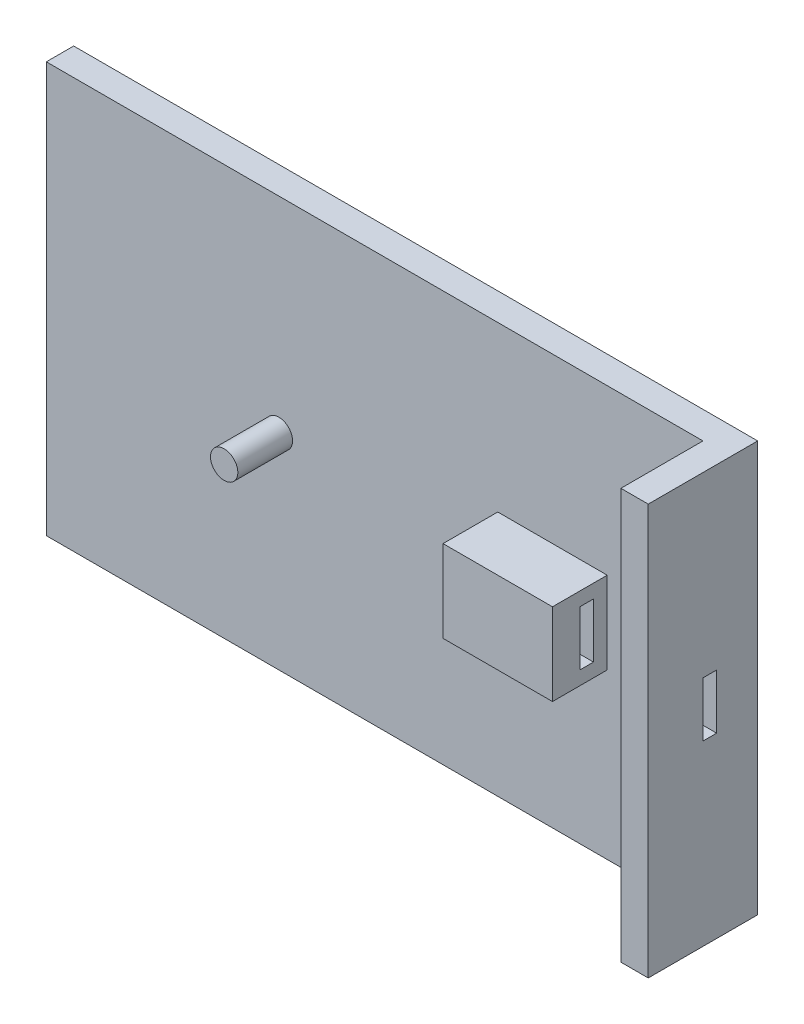
ISO-10303-21;
HEADER;
FILE_DESCRIPTION(('STEP AP214'),'2;1');
FILE_NAME('part.step','',(''),(''),'','','');
FILE_SCHEMA(('AUTOMOTIVE_DESIGN { 1 0 10303 214 1 1 1 1 }'));
ENDSEC;
DATA;
#1=APPLICATION_CONTEXT('core data for automotive mechanical design processes');
#2=APPLICATION_PROTOCOL_DEFINITION('international standard','automotive_design',2000,#1);
#3=PRODUCT_CONTEXT('',#1,'mechanical');
#4=PRODUCT('Part','Part','',(#3));
#5=PRODUCT_RELATED_PRODUCT_CATEGORY('part','',(#4));
#6=PRODUCT_DEFINITION_FORMATION('','',#4);
#7=PRODUCT_DEFINITION_CONTEXT('part definition',#1,'design');
#8=PRODUCT_DEFINITION('design','',#6,#7);
#9=PRODUCT_DEFINITION_SHAPE('','',#8);
#10=(LENGTH_UNIT() NAMED_UNIT(*) SI_UNIT(.MILLI.,.METRE.));
#11=(NAMED_UNIT(*) PLANE_ANGLE_UNIT() SI_UNIT($,.RADIAN.));
#12=(NAMED_UNIT(*) SI_UNIT($,.STERADIAN.) SOLID_ANGLE_UNIT());
#13=UNCERTAINTY_MEASURE_WITH_UNIT(LENGTH_MEASURE(1.E-05),#10,'distance_accuracy_value','');
#14=(GEOMETRIC_REPRESENTATION_CONTEXT(3) GLOBAL_UNCERTAINTY_ASSIGNED_CONTEXT((#13)) GLOBAL_UNIT_ASSIGNED_CONTEXT((#10,
#11,#12)) REPRESENTATION_CONTEXT('',''));
#15=CARTESIAN_POINT('',(0.,0.,0.));
#16=DIRECTION('',(0.,0.,1.));
#17=DIRECTION('',(1.,0.,0.));
#18=AXIS2_PLACEMENT_3D('',#15,#16,#17);
#19=CARTESIAN_POINT('',(0.,0.,10.));
#20=DIRECTION('',(0.,0.,1.));
#21=DIRECTION('',(1.,0.,0.));
#22=AXIS2_PLACEMENT_3D('',#19,#20,#21);
#23=PLANE('',#22);
#24=DIRECTION('',(1.,0.,0.));
#25=VECTOR('',#24,1.);
#26=CARTESIAN_POINT('',(0.,15.,10.));
#27=LINE('',#26,#25);
#28=CARTESIAN_POINT('',(40.,15.,10.));
#29=VERTEX_POINT('',#28);
#30=CARTESIAN_POINT('',(80.,15.,10.));
#31=VERTEX_POINT('',#30);
#32=EDGE_CURVE('E294',#29,#31,#27,.T.);
#33=ORIENTED_EDGE('',*,*,#32,.T.);
#34=DIRECTION('',(0.,-1.,0.));
#35=VECTOR('',#34,1.);
#36=CARTESIAN_POINT('',(80.,0.,10.));
#37=LINE('',#36,#35);
#38=CARTESIAN_POINT('',(80.,-15.,10.));
#39=VERTEX_POINT('',#38);
#40=EDGE_CURVE('E281',#31,#39,#37,.T.);
#41=ORIENTED_EDGE('',*,*,#40,.T.);
#42=DIRECTION('',(1.,0.,0.));
#43=VECTOR('',#42,1.);
#44=CARTESIAN_POINT('',(0.,-15.,10.));
#45=LINE('',#44,#43);
#46=CARTESIAN_POINT('',(40.,-15.,10.));
#47=VERTEX_POINT('',#46);
#48=EDGE_CURVE('E284',#47,#39,#45,.T.);
#49=ORIENTED_EDGE('',*,*,#48,.F.);
#50=DIRECTION('',(0.,-1.,0.));
#51=VECTOR('',#50,1.);
#52=CARTESIAN_POINT('',(40.,0.,10.));
#53=LINE('',#52,#51);
#54=EDGE_CURVE('E278',#29,#47,#53,.T.);
#55=ORIENTED_EDGE('',*,*,#54,.F.);
#56=EDGE_LOOP('',(#33,#41,#49,#55));
#57=FACE_BOUND('',#56,.T.);
#58=CARTESIAN_POINT('',(-40.,0.,10.));
#59=DIRECTION('',(0.,0.,1.));
#60=DIRECTION('',(1.,0.,0.));
#61=AXIS2_PLACEMENT_3D('',#58,#59,#60);
#62=CIRCLE('',#61,5.);
#63=CARTESIAN_POINT('',(-35.,0.,10.));
#64=VERTEX_POINT('',#63);
#65=EDGE_CURVE('E275',#64,#64,#62,.T.);
#66=ORIENTED_EDGE('',*,*,#65,.F.);
#67=EDGE_LOOP('',(#66));
#68=FACE_BOUND('',#67,.T.);
#69=DIRECTION('',(1.,0.,0.));
#70=VECTOR('',#69,1.);
#71=CARTESIAN_POINT('',(0.,-75.,10.));
#72=LINE('',#71,#70);
#73=CARTESIAN_POINT('',(-125.,-75.,10.));
#74=VERTEX_POINT('',#73);
#75=CARTESIAN_POINT('',(115.,-75.,10.));
#76=VERTEX_POINT('',#75);
#77=EDGE_CURVE('E289',#74,#76,#72,.T.);
#78=ORIENTED_EDGE('',*,*,#77,.T.);
#79=DIRECTION('',(0.,1.,0.));
#80=VECTOR('',#79,1.);
#81=CARTESIAN_POINT('',(115.,0.,10.));
#82=LINE('',#81,#80);
#83=CARTESIAN_POINT('',(115.,75.,10.));
#84=VERTEX_POINT('',#83);
#85=EDGE_CURVE('E272',#76,#84,#82,.T.);
#86=ORIENTED_EDGE('',*,*,#85,.T.);
#87=DIRECTION('',(1.,0.,0.));
#88=VECTOR('',#87,1.);
#89=CARTESIAN_POINT('',(0.,75.,10.));
#90=LINE('',#89,#88);
#91=CARTESIAN_POINT('',(-125.,75.,10.));
#92=VERTEX_POINT('',#91);
#93=EDGE_CURVE('E291',#92,#84,#90,.T.);
#94=ORIENTED_EDGE('',*,*,#93,.F.);
#95=DIRECTION('',(0.,-1.,0.));
#96=VECTOR('',#95,1.);
#97=CARTESIAN_POINT('',(-125.,0.,10.));
#98=LINE('',#97,#96);
#99=EDGE_CURVE('E286',#92,#74,#98,.T.);
#100=ORIENTED_EDGE('',*,*,#99,.T.);
#101=EDGE_LOOP('',(#78,#86,#94,#100));
#102=FACE_BOUND('',#101,.T.);
#103=ADVANCED_FACE('F39',(#57,#68,#102),#23,.T.);
#104=CARTESIAN_POINT('',(-125.,0.,10.));
#105=DIRECTION('',(1.,0.,0.));
#106=DIRECTION('',(0.,0.,-1.));
#107=AXIS2_PLACEMENT_3D('',#104,#105,#106);
#108=PLANE('',#107);
#109=DIRECTION('',(0.,-1.,0.));
#110=VECTOR('',#109,1.);
#111=CARTESIAN_POINT('',(-125.,0.,0.));
#112=LINE('',#111,#110);
#113=CARTESIAN_POINT('',(-125.,75.,0.));
#114=VERTEX_POINT('',#113);
#115=CARTESIAN_POINT('',(-125.,-75.,0.));
#116=VERTEX_POINT('',#115);
#117=EDGE_CURVE('E274',#114,#116,#112,.T.);
#118=ORIENTED_EDGE('',*,*,#117,.T.);
#119=DIRECTION('',(0.,0.,-1.));
#120=VECTOR('',#119,1.);
#121=CARTESIAN_POINT('',(-125.,-75.,10.));
#122=LINE('',#121,#120);
#123=EDGE_CURVE('E47',#74,#116,#122,.T.);
#124=ORIENTED_EDGE('',*,*,#123,.F.);
#125=ORIENTED_EDGE('',*,*,#99,.F.);
#126=DIRECTION('',(0.,0.,-1.));
#127=VECTOR('',#126,1.);
#128=CARTESIAN_POINT('',(-125.,75.,10.));
#129=LINE('',#128,#127);
#130=EDGE_CURVE('E297',#92,#114,#129,.T.);
#131=ORIENTED_EDGE('',*,*,#130,.T.);
#132=EDGE_LOOP('',(#118,#124,#125,#131));
#133=FACE_BOUND('',#132,.T.);
#134=ADVANCED_FACE('F41',(#133),#108,.F.);
#135=CARTESIAN_POINT('',(0.,-75.,10.));
#136=DIRECTION('',(0.,1.,0.));
#137=DIRECTION('',(0.,0.,1.));
#138=AXIS2_PLACEMENT_3D('',#135,#136,#137);
#139=PLANE('',#138);
#140=DIRECTION('',(0.,0.,-1.));
#141=VECTOR('',#140,1.);
#142=CARTESIAN_POINT('',(125.,-75.,10.));
#143=LINE('',#142,#141);
#144=CARTESIAN_POINT('',(125.,-75.,40.));
#145=VERTEX_POINT('',#144);
#146=CARTESIAN_POINT('',(125.,-75.,0.));
#147=VERTEX_POINT('',#146);
#148=EDGE_CURVE('E310',#145,#147,#143,.T.);
#149=ORIENTED_EDGE('',*,*,#148,.F.);
#150=DIRECTION('',(1.,0.,0.));
#151=VECTOR('',#150,1.);
#152=CARTESIAN_POINT('',(0.,-75.,40.));
#153=LINE('',#152,#151);
#154=CARTESIAN_POINT('',(115.,-75.,40.));
#155=VERTEX_POINT('',#154);
#156=EDGE_CURVE('E263',#155,#145,#153,.T.);
#157=ORIENTED_EDGE('',*,*,#156,.F.);
#158=DIRECTION('',(0.,0.,-1.));
#159=VECTOR('',#158,1.);
#160=CARTESIAN_POINT('',(115.,-75.,40.));
#161=LINE('',#160,#159);
#162=EDGE_CURVE('E266',#155,#76,#161,.T.);
#163=ORIENTED_EDGE('',*,*,#162,.T.);
#164=ORIENTED_EDGE('',*,*,#77,.F.);
#165=ORIENTED_EDGE('',*,*,#123,.T.);
#166=DIRECTION('',(1.,0.,0.));
#167=VECTOR('',#166,1.);
#168=CARTESIAN_POINT('',(0.,-75.,0.));
#169=LINE('',#168,#167);
#170=EDGE_CURVE('E300',#116,#147,#169,.T.);
#171=ORIENTED_EDGE('',*,*,#170,.T.);
#172=EDGE_LOOP('',(#149,#157,#163,#164,#165,#171));
#173=FACE_BOUND('',#172,.T.);
#174=ADVANCED_FACE('F315',(#173),#139,.F.);
#175=CARTESIAN_POINT('',(125.,0.,10.));
#176=DIRECTION('',(1.,0.,0.));
#177=DIRECTION('',(0.,0.,-1.));
#178=AXIS2_PLACEMENT_3D('',#175,#176,#177);
#179=PLANE('',#178);
#180=DIRECTION('',(0.,0.,1.));
#181=VECTOR('',#180,1.);
#182=CARTESIAN_POINT('',(125.,-10.,15.));
#183=LINE('',#182,#181);
#184=CARTESIAN_POINT('',(125.,-10.,15.));
#185=VERTEX_POINT('',#184);
#186=CARTESIAN_POINT('',(125.,-10.,20.));
#187=VERTEX_POINT('',#186);
#188=EDGE_CURVE('E178',#185,#187,#183,.T.);
#189=ORIENTED_EDGE('',*,*,#188,.T.);
#190=DIRECTION('',(0.,1.,0.));
#191=VECTOR('',#190,1.);
#192=CARTESIAN_POINT('',(125.,10.,20.));
#193=LINE('',#192,#191);
#194=CARTESIAN_POINT('',(125.,10.,20.));
#195=VERTEX_POINT('',#194);
#196=EDGE_CURVE('E165',#187,#195,#193,.T.);
#197=ORIENTED_EDGE('',*,*,#196,.T.);
#198=DIRECTION('',(0.,0.,-1.));
#199=VECTOR('',#198,1.);
#200=CARTESIAN_POINT('',(125.,10.,15.));
#201=LINE('',#200,#199);
#202=CARTESIAN_POINT('',(125.,10.,15.));
#203=VERTEX_POINT('',#202);
#204=EDGE_CURVE('E196',#195,#203,#201,.T.);
#205=ORIENTED_EDGE('',*,*,#204,.T.);
#206=DIRECTION('',(0.,-1.,0.));
#207=VECTOR('',#206,1.);
#208=CARTESIAN_POINT('',(125.,10.,15.));
#209=LINE('',#208,#207);
#210=EDGE_CURVE('E186',#203,#185,#209,.T.);
#211=ORIENTED_EDGE('',*,*,#210,.T.);
#212=EDGE_LOOP('',(#189,#197,#205,#211));
#213=FACE_BOUND('',#212,.T.);
#214=DIRECTION('',(0.,-1.,0.));
#215=VECTOR('',#214,1.);
#216=CARTESIAN_POINT('',(125.,0.,0.));
#217=LINE('',#216,#215);
#218=CARTESIAN_POINT('',(125.,75.,0.));
#219=VERTEX_POINT('',#218);
#220=EDGE_CURVE('E302',#219,#147,#217,.T.);
#221=ORIENTED_EDGE('',*,*,#220,.F.);
#222=DIRECTION('',(0.,0.,-1.));
#223=VECTOR('',#222,1.);
#224=CARTESIAN_POINT('',(125.,75.,10.));
#225=LINE('',#224,#223);
#226=CARTESIAN_POINT('',(125.,75.,40.));
#227=VERTEX_POINT('',#226);
#228=EDGE_CURVE('E307',#227,#219,#225,.T.);
#229=ORIENTED_EDGE('',*,*,#228,.F.);
#230=DIRECTION('',(0.,-1.,0.));
#231=VECTOR('',#230,1.);
#232=CARTESIAN_POINT('',(125.,0.,40.));
#233=LINE('',#232,#231);
#234=EDGE_CURVE('E255',#227,#145,#233,.T.);
#235=ORIENTED_EDGE('',*,*,#234,.T.);
#236=ORIENTED_EDGE('',*,*,#148,.T.);
#237=EDGE_LOOP('',(#221,#229,#235,#236));
#238=FACE_BOUND('',#237,.T.);
#239=ADVANCED_FACE('F184',(#213,#238),#179,.T.);
#240=CARTESIAN_POINT('',(0.,75.,10.));
#241=DIRECTION('',(0.,1.,0.));
#242=DIRECTION('',(0.,0.,1.));
#243=AXIS2_PLACEMENT_3D('',#240,#241,#242);
#244=PLANE('',#243);
#245=ORIENTED_EDGE('',*,*,#228,.T.);
#246=DIRECTION('',(1.,0.,0.));
#247=VECTOR('',#246,1.);
#248=CARTESIAN_POINT('',(0.,75.,0.));
#249=LINE('',#248,#247);
#250=EDGE_CURVE('E279',#114,#219,#249,.T.);
#251=ORIENTED_EDGE('',*,*,#250,.F.);
#252=ORIENTED_EDGE('',*,*,#130,.F.);
#253=ORIENTED_EDGE('',*,*,#93,.T.);
#254=DIRECTION('',(0.,0.,-1.));
#255=VECTOR('',#254,1.);
#256=CARTESIAN_POINT('',(115.,75.,40.));
#257=LINE('',#256,#255);
#258=CARTESIAN_POINT('',(115.,75.,40.));
#259=VERTEX_POINT('',#258);
#260=EDGE_CURVE('E269',#259,#84,#257,.T.);
#261=ORIENTED_EDGE('',*,*,#260,.F.);
#262=DIRECTION('',(1.,0.,0.));
#263=VECTOR('',#262,1.);
#264=CARTESIAN_POINT('',(0.,75.,40.));
#265=LINE('',#264,#263);
#266=EDGE_CURVE('E258',#259,#227,#265,.T.);
#267=ORIENTED_EDGE('',*,*,#266,.T.);
#268=EDGE_LOOP('',(#245,#251,#252,#253,#261,#267));
#269=FACE_BOUND('',#268,.T.);
#270=ADVANCED_FACE('F323',(#269),#244,.T.);
#271=CARTESIAN_POINT('',(0.,0.,0.));
#272=DIRECTION('',(0.,0.,1.));
#273=DIRECTION('',(1.,0.,0.));
#274=AXIS2_PLACEMENT_3D('',#271,#272,#273);
#275=PLANE('',#274);
#276=ORIENTED_EDGE('',*,*,#220,.T.);
#277=ORIENTED_EDGE('',*,*,#170,.F.);
#278=ORIENTED_EDGE('',*,*,#117,.F.);
#279=ORIENTED_EDGE('',*,*,#250,.T.);
#280=EDGE_LOOP('',(#276,#277,#278,#279));
#281=FACE_BOUND('',#280,.T.);
#282=ADVANCED_FACE('F321',(#281),#275,.F.);
#283=CARTESIAN_POINT('',(115.,0.,40.));
#284=DIRECTION('',(1.,0.,0.));
#285=DIRECTION('',(0.,0.,-1.));
#286=AXIS2_PLACEMENT_3D('',#283,#284,#285);
#287=PLANE('',#286);
#288=DIRECTION('',(0.,1.,0.));
#289=VECTOR('',#288,1.);
#290=CARTESIAN_POINT('',(115.,10.,20.));
#291=LINE('',#290,#289);
#292=CARTESIAN_POINT('',(115.,-10.,20.));
#293=VERTEX_POINT('',#292);
#294=CARTESIAN_POINT('',(115.,10.,20.));
#295=VERTEX_POINT('',#294);
#296=EDGE_CURVE('E188',#293,#295,#291,.T.);
#297=ORIENTED_EDGE('',*,*,#296,.F.);
#298=DIRECTION('',(0.,0.,1.));
#299=VECTOR('',#298,1.);
#300=CARTESIAN_POINT('',(115.,-10.,15.));
#301=LINE('',#300,#299);
#302=CARTESIAN_POINT('',(115.,-10.,15.));
#303=VERTEX_POINT('',#302);
#304=EDGE_CURVE('E181',#303,#293,#301,.T.);
#305=ORIENTED_EDGE('',*,*,#304,.F.);
#306=DIRECTION('',(0.,-1.,0.));
#307=VECTOR('',#306,1.);
#308=CARTESIAN_POINT('',(115.,10.,15.));
#309=LINE('',#308,#307);
#310=CARTESIAN_POINT('',(115.,10.,15.));
#311=VERTEX_POINT('',#310);
#312=EDGE_CURVE('E192',#311,#303,#309,.T.);
#313=ORIENTED_EDGE('',*,*,#312,.F.);
#314=DIRECTION('',(0.,0.,-1.));
#315=VECTOR('',#314,1.);
#316=CARTESIAN_POINT('',(115.,10.,15.));
#317=LINE('',#316,#315);
#318=EDGE_CURVE('E62',#295,#311,#317,.T.);
#319=ORIENTED_EDGE('',*,*,#318,.F.);
#320=EDGE_LOOP('',(#297,#305,#313,#319));
#321=FACE_BOUND('',#320,.T.);
#322=ORIENTED_EDGE('',*,*,#85,.F.);
#323=ORIENTED_EDGE('',*,*,#162,.F.);
#324=DIRECTION('',(0.,-1.,0.));
#325=VECTOR('',#324,1.);
#326=CARTESIAN_POINT('',(115.,0.,40.));
#327=LINE('',#326,#325);
#328=EDGE_CURVE('E261',#259,#155,#327,.T.);
#329=ORIENTED_EDGE('',*,*,#328,.F.);
#330=ORIENTED_EDGE('',*,*,#260,.T.);
#331=EDGE_LOOP('',(#322,#323,#329,#330));
#332=FACE_BOUND('',#331,.T.);
#333=ADVANCED_FACE('F334',(#321,#332),#287,.F.);
#334=CARTESIAN_POINT('',(0.,0.,40.));
#335=DIRECTION('',(0.,0.,1.));
#336=DIRECTION('',(1.,0.,0.));
#337=AXIS2_PLACEMENT_3D('',#334,#335,#336);
#338=PLANE('',#337);
#339=ORIENTED_EDGE('',*,*,#234,.F.);
#340=ORIENTED_EDGE('',*,*,#266,.F.);
#341=ORIENTED_EDGE('',*,*,#328,.T.);
#342=ORIENTED_EDGE('',*,*,#156,.T.);
#343=EDGE_LOOP('',(#339,#340,#341,#342));
#344=FACE_BOUND('',#343,.T.);
#345=ADVANCED_FACE('F329',(#344),#338,.T.);
#346=CARTESIAN_POINT('',(-40.,0.,30.));
#347=DIRECTION('',(0.,0.,-1.));
#348=DIRECTION('',(-1.,0.,0.));
#349=AXIS2_PLACEMENT_3D('',#346,#347,#348);
#350=CYLINDRICAL_SURFACE('',#349,5.);
#351=ORIENTED_EDGE('',*,*,#65,.T.);
#352=EDGE_LOOP('',(#351));
#353=FACE_BOUND('',#352,.T.);
#354=CARTESIAN_POINT('',(-40.,0.,30.));
#355=DIRECTION('',(0.,0.,1.));
#356=DIRECTION('',(1.,0.,0.));
#357=AXIS2_PLACEMENT_3D('',#354,#355,#356);
#358=CIRCLE('',#357,5.);
#359=CARTESIAN_POINT('',(-35.,0.,30.));
#360=VERTEX_POINT('',#359);
#361=EDGE_CURVE('E252',#360,#360,#358,.T.);
#362=ORIENTED_EDGE('',*,*,#361,.F.);
#363=EDGE_LOOP('',(#362));
#364=FACE_BOUND('',#363,.T.);
#365=ADVANCED_FACE('F385',(#353,#364),#350,.T.);
#366=CARTESIAN_POINT('',(0.,0.,30.));
#367=DIRECTION('',(0.,0.,1.));
#368=DIRECTION('',(1.,0.,0.));
#369=AXIS2_PLACEMENT_3D('',#366,#367,#368);
#370=PLANE('',#369);
#371=ORIENTED_EDGE('',*,*,#361,.T.);
#372=EDGE_LOOP('',(#371));
#373=FACE_BOUND('',#372,.T.);
#374=ADVANCED_FACE('F391',(#373),#370,.T.);
#375=CARTESIAN_POINT('',(40.,15.,30.));
#376=DIRECTION('',(1.,0.,0.));
#377=DIRECTION('',(0.,0.,-1.));
#378=AXIS2_PLACEMENT_3D('',#375,#376,#377);
#379=PLANE('',#378);
#380=DIRECTION('',(0.,-1.,0.));
#381=VECTOR('',#380,1.);
#382=CARTESIAN_POINT('',(40.,10.,20.));
#383=LINE('',#382,#381);
#384=CARTESIAN_POINT('',(40.,10.,20.));
#385=VERTEX_POINT('',#384);
#386=CARTESIAN_POINT('',(40.,-10.,20.));
#387=VERTEX_POINT('',#386);
#388=EDGE_CURVE('E201',#385,#387,#383,.T.);
#389=ORIENTED_EDGE('',*,*,#388,.T.);
#390=DIRECTION('',(0.,0.,-1.));
#391=VECTOR('',#390,1.);
#392=CARTESIAN_POINT('',(40.,-10.,30.));
#393=LINE('',#392,#391);
#394=CARTESIAN_POINT('',(40.,-10.,15.));
#395=VERTEX_POINT('',#394);
#396=EDGE_CURVE('E230',#387,#395,#393,.T.);
#397=ORIENTED_EDGE('',*,*,#396,.T.);
#398=DIRECTION('',(0.,1.,0.));
#399=VECTOR('',#398,1.);
#400=CARTESIAN_POINT('',(40.,10.,15.));
#401=LINE('',#400,#399);
#402=CARTESIAN_POINT('',(40.,10.,15.));
#403=VERTEX_POINT('',#402);
#404=EDGE_CURVE('E208',#395,#403,#401,.T.);
#405=ORIENTED_EDGE('',*,*,#404,.T.);
#406=DIRECTION('',(0.,0.,-1.));
#407=VECTOR('',#406,1.);
#408=CARTESIAN_POINT('',(40.,10.,30.));
#409=LINE('',#408,#407);
#410=EDGE_CURVE('E250',#385,#403,#409,.T.);
#411=ORIENTED_EDGE('',*,*,#410,.F.);
#412=EDGE_LOOP('',(#389,#397,#405,#411));
#413=FACE_BOUND('',#412,.T.);
#414=DIRECTION('',(0.,0.,-1.));
#415=VECTOR('',#414,1.);
#416=CARTESIAN_POINT('',(40.,-15.,30.));
#417=LINE('',#416,#415);
#418=CARTESIAN_POINT('',(40.,-15.,30.));
#419=VERTEX_POINT('',#418);
#420=EDGE_CURVE('E220',#419,#47,#417,.T.);
#421=ORIENTED_EDGE('',*,*,#420,.F.);
#422=DIRECTION('',(0.,-1.,0.));
#423=VECTOR('',#422,1.);
#424=CARTESIAN_POINT('',(40.,15.,30.));
#425=LINE('',#424,#423);
#426=CARTESIAN_POINT('',(40.,15.,30.));
#427=VERTEX_POINT('',#426);
#428=EDGE_CURVE('E235',#427,#419,#425,.T.);
#429=ORIENTED_EDGE('',*,*,#428,.F.);
#430=DIRECTION('',(0.,0.,-1.));
#431=VECTOR('',#430,1.);
#432=CARTESIAN_POINT('',(40.,15.,30.));
#433=LINE('',#432,#431);
#434=EDGE_CURVE('E242',#427,#29,#433,.T.);
#435=ORIENTED_EDGE('',*,*,#434,.T.);
#436=ORIENTED_EDGE('',*,*,#54,.T.);
#437=EDGE_LOOP('',(#421,#429,#435,#436));
#438=FACE_BOUND('',#437,.T.);
#439=ADVANCED_FACE('F398',(#413,#438),#379,.F.);
#440=CARTESIAN_POINT('',(40.,10.,30.));
#441=DIRECTION('',(0.,1.,0.));
#442=DIRECTION('',(-1.,0.,0.));
#443=AXIS2_PLACEMENT_3D('',#440,#441,#442);
#444=PLANE('',#443);
#445=DIRECTION('',(0.,0.,-1.));
#446=VECTOR('',#445,1.);
#447=CARTESIAN_POINT('',(80.,10.,30.));
#448=LINE('',#447,#446);
#449=CARTESIAN_POINT('',(80.,10.,20.));
#450=VERTEX_POINT('',#449);
#451=CARTESIAN_POINT('',(80.,10.,15.));
#452=VERTEX_POINT('',#451);
#453=EDGE_CURVE('E248',#450,#452,#448,.T.);
#454=ORIENTED_EDGE('',*,*,#453,.F.);
#455=DIRECTION('',(-1.,0.,0.));
#456=VECTOR('',#455,1.);
#457=CARTESIAN_POINT('',(102.556566506766,10.,20.));
#458=LINE('',#457,#456);
#459=EDGE_CURVE('E204',#450,#385,#458,.T.);
#460=ORIENTED_EDGE('',*,*,#459,.T.);
#461=ORIENTED_EDGE('',*,*,#410,.T.);
#462=DIRECTION('',(-1.,0.,0.));
#463=VECTOR('',#462,1.);
#464=CARTESIAN_POINT('',(102.556566506766,10.,15.));
#465=LINE('',#464,#463);
#466=EDGE_CURVE('E217',#452,#403,#465,.T.);
#467=ORIENTED_EDGE('',*,*,#466,.F.);
#468=EDGE_LOOP('',(#454,#460,#461,#467));
#469=FACE_BOUND('',#468,.T.);
#470=ADVANCED_FACE('F406',(#469),#444,.F.);
#471=CARTESIAN_POINT('',(80.,15.,30.));
#472=DIRECTION('',(1.,0.,0.));
#473=DIRECTION('',(0.,0.,-1.));
#474=AXIS2_PLACEMENT_3D('',#471,#472,#473);
#475=PLANE('',#474);
#476=DIRECTION('',(0.,-1.,0.));
#477=VECTOR('',#476,1.);
#478=CARTESIAN_POINT('',(80.,10.,20.));
#479=LINE('',#478,#477);
#480=CARTESIAN_POINT('',(80.,-10.,20.));
#481=VERTEX_POINT('',#480);
#482=EDGE_CURVE('E205',#450,#481,#479,.T.);
#483=ORIENTED_EDGE('',*,*,#482,.F.);
#484=ORIENTED_EDGE('',*,*,#453,.T.);
#485=DIRECTION('',(0.,1.,0.));
#486=VECTOR('',#485,1.);
#487=CARTESIAN_POINT('',(80.,10.,15.));
#488=LINE('',#487,#486);
#489=CARTESIAN_POINT('',(80.,-10.,15.));
#490=VERTEX_POINT('',#489);
#491=EDGE_CURVE('E214',#490,#452,#488,.T.);
#492=ORIENTED_EDGE('',*,*,#491,.F.);
#493=DIRECTION('',(0.,0.,-1.));
#494=VECTOR('',#493,1.);
#495=CARTESIAN_POINT('',(80.,-10.,30.));
#496=LINE('',#495,#494);
#497=EDGE_CURVE('E228',#481,#490,#496,.T.);
#498=ORIENTED_EDGE('',*,*,#497,.F.);
#499=EDGE_LOOP('',(#483,#484,#492,#498));
#500=FACE_BOUND('',#499,.T.);
#501=DIRECTION('',(0.,-1.,0.));
#502=VECTOR('',#501,1.);
#503=CARTESIAN_POINT('',(80.,15.,30.));
#504=LINE('',#503,#502);
#505=CARTESIAN_POINT('',(80.,15.,30.));
#506=VERTEX_POINT('',#505);
#507=CARTESIAN_POINT('',(80.,-15.,30.));
#508=VERTEX_POINT('',#507);
#509=EDGE_CURVE('E237',#506,#508,#504,.T.);
#510=ORIENTED_EDGE('',*,*,#509,.T.);
#511=DIRECTION('',(0.,0.,-1.));
#512=VECTOR('',#511,1.);
#513=CARTESIAN_POINT('',(80.,-15.,30.));
#514=LINE('',#513,#512);
#515=EDGE_CURVE('E225',#508,#39,#514,.T.);
#516=ORIENTED_EDGE('',*,*,#515,.T.);
#517=ORIENTED_EDGE('',*,*,#40,.F.);
#518=DIRECTION('',(0.,0.,-1.));
#519=VECTOR('',#518,1.);
#520=CARTESIAN_POINT('',(80.,15.,30.));
#521=LINE('',#520,#519);
#522=EDGE_CURVE('E245',#506,#31,#521,.T.);
#523=ORIENTED_EDGE('',*,*,#522,.F.);
#524=EDGE_LOOP('',(#510,#516,#517,#523));
#525=FACE_BOUND('',#524,.T.);
#526=ADVANCED_FACE('F414',(#500,#525),#475,.T.);
#527=CARTESIAN_POINT('',(40.,15.,30.));
#528=DIRECTION('',(0.,1.,0.));
#529=DIRECTION('',(0.,0.,1.));
#530=AXIS2_PLACEMENT_3D('',#527,#528,#529);
#531=PLANE('',#530);
#532=ORIENTED_EDGE('',*,*,#522,.T.);
#533=ORIENTED_EDGE('',*,*,#32,.F.);
#534=ORIENTED_EDGE('',*,*,#434,.F.);
#535=DIRECTION('',(1.,0.,0.));
#536=VECTOR('',#535,1.);
#537=CARTESIAN_POINT('',(40.,15.,30.));
#538=LINE('',#537,#536);
#539=EDGE_CURVE('E239',#427,#506,#538,.T.);
#540=ORIENTED_EDGE('',*,*,#539,.T.);
#541=EDGE_LOOP('',(#532,#533,#534,#540));
#542=FACE_BOUND('',#541,.T.);
#543=ADVANCED_FACE('F422',(#542),#531,.T.);
#544=CARTESIAN_POINT('',(0.,0.,30.));
#545=DIRECTION('',(0.,0.,1.));
#546=DIRECTION('',(1.,0.,0.));
#547=AXIS2_PLACEMENT_3D('',#544,#545,#546);
#548=PLANE('',#547);
#549=ORIENTED_EDGE('',*,*,#428,.T.);
#550=DIRECTION('',(1.,0.,0.));
#551=VECTOR('',#550,1.);
#552=CARTESIAN_POINT('',(40.,-15.,30.));
#553=LINE('',#552,#551);
#554=EDGE_CURVE('E232',#419,#508,#553,.T.);
#555=ORIENTED_EDGE('',*,*,#554,.T.);
#556=ORIENTED_EDGE('',*,*,#509,.F.);
#557=ORIENTED_EDGE('',*,*,#539,.F.);
#558=EDGE_LOOP('',(#549,#555,#556,#557));
#559=FACE_BOUND('',#558,.T.);
#560=ADVANCED_FACE('F430',(#559),#548,.T.);
#561=CARTESIAN_POINT('',(40.,-15.,30.));
#562=DIRECTION('',(0.,1.,0.));
#563=DIRECTION('',(0.,0.,1.));
#564=AXIS2_PLACEMENT_3D('',#561,#562,#563);
#565=PLANE('',#564);
#566=ORIENTED_EDGE('',*,*,#48,.T.);
#567=ORIENTED_EDGE('',*,*,#515,.F.);
#568=ORIENTED_EDGE('',*,*,#554,.F.);
#569=ORIENTED_EDGE('',*,*,#420,.T.);
#570=EDGE_LOOP('',(#566,#567,#568,#569));
#571=FACE_BOUND('',#570,.T.);
#572=ADVANCED_FACE('F438',(#571),#565,.F.);
#573=CARTESIAN_POINT('',(40.,-10.,30.));
#574=DIRECTION('',(0.,1.,0.));
#575=DIRECTION('',(-1.,0.,0.));
#576=AXIS2_PLACEMENT_3D('',#573,#574,#575);
#577=PLANE('',#576);
#578=DIRECTION('',(-1.,0.,0.));
#579=VECTOR('',#578,1.);
#580=CARTESIAN_POINT('',(40.,-10.,20.));
#581=LINE('',#580,#579);
#582=EDGE_CURVE('E11',#481,#387,#581,.T.);
#583=ORIENTED_EDGE('',*,*,#582,.F.);
#584=ORIENTED_EDGE('',*,*,#497,.T.);
#585=DIRECTION('',(-1.,0.,0.));
#586=VECTOR('',#585,1.);
#587=CARTESIAN_POINT('',(102.556566506766,-10.,15.));
#588=LINE('',#587,#586);
#589=EDGE_CURVE('E213',#490,#395,#588,.T.);
#590=ORIENTED_EDGE('',*,*,#589,.T.);
#591=ORIENTED_EDGE('',*,*,#396,.F.);
#592=EDGE_LOOP('',(#583,#584,#590,#591));
#593=FACE_BOUND('',#592,.T.);
#594=ADVANCED_FACE('F446',(#593),#577,.T.);
#595=CARTESIAN_POINT('',(102.556566506766,10.,15.));
#596=DIRECTION('',(0.,0.,1.));
#597=DIRECTION('',(0.,-1.,0.));
#598=AXIS2_PLACEMENT_3D('',#595,#596,#597);
#599=PLANE('',#598);
#600=ORIENTED_EDGE('',*,*,#589,.F.);
#601=ORIENTED_EDGE('',*,*,#491,.T.);
#602=ORIENTED_EDGE('',*,*,#466,.T.);
#603=ORIENTED_EDGE('',*,*,#404,.F.);
#604=EDGE_LOOP('',(#600,#601,#602,#603));
#605=FACE_BOUND('',#604,.T.);
#606=ADVANCED_FACE('F453',(#605),#599,.T.);
#607=CARTESIAN_POINT('',(102.556566506766,10.,20.));
#608=DIRECTION('',(0.,0.,-1.));
#609=DIRECTION('',(-1.,0.,0.));
#610=AXIS2_PLACEMENT_3D('',#607,#608,#609);
#611=PLANE('',#610);
#612=ORIENTED_EDGE('',*,*,#482,.T.);
#613=ORIENTED_EDGE('',*,*,#582,.T.);
#614=ORIENTED_EDGE('',*,*,#388,.F.);
#615=ORIENTED_EDGE('',*,*,#459,.F.);
#616=EDGE_LOOP('',(#612,#613,#614,#615));
#617=FACE_BOUND('',#616,.T.);
#618=ADVANCED_FACE('F461',(#617),#611,.T.);
#619=CARTESIAN_POINT('',(145.615528128088,-10.,15.));
#620=DIRECTION('',(0.,-1.,0.));
#621=DIRECTION('',(0.,0.,-1.));
#622=AXIS2_PLACEMENT_3D('',#619,#620,#621);
#623=PLANE('',#622);
#624=DIRECTION('',(-1.,0.,0.));
#625=VECTOR('',#624,1.);
#626=CARTESIAN_POINT('',(145.615528128088,-10.,15.));
#627=LINE('',#626,#625);
#628=EDGE_CURVE('E54',#185,#303,#627,.T.);
#629=ORIENTED_EDGE('',*,*,#628,.T.);
#630=ORIENTED_EDGE('',*,*,#304,.T.);
#631=DIRECTION('',(-1.,0.,0.));
#632=VECTOR('',#631,1.);
#633=CARTESIAN_POINT('',(145.615528128088,-10.,20.));
#634=LINE('',#633,#632);
#635=EDGE_CURVE('E169',#187,#293,#634,.T.);
#636=ORIENTED_EDGE('',*,*,#635,.F.);
#637=ORIENTED_EDGE('',*,*,#188,.F.);
#638=EDGE_LOOP('',(#629,#630,#636,#637));
#639=FACE_BOUND('',#638,.T.);
#640=ADVANCED_FACE('F177',(#639),#623,.F.);
#641=CARTESIAN_POINT('',(145.615528128088,10.,20.));
#642=DIRECTION('',(0.,0.,1.));
#643=DIRECTION('',(1.,0.,0.));
#644=AXIS2_PLACEMENT_3D('',#641,#642,#643);
#645=PLANE('',#644);
#646=ORIENTED_EDGE('',*,*,#635,.T.);
#647=ORIENTED_EDGE('',*,*,#296,.T.);
#648=DIRECTION('',(-1.,0.,0.));
#649=VECTOR('',#648,1.);
#650=CARTESIAN_POINT('',(145.615528128088,10.,20.));
#651=LINE('',#650,#649);
#652=EDGE_CURVE('E171',#195,#295,#651,.T.);
#653=ORIENTED_EDGE('',*,*,#652,.F.);
#654=ORIENTED_EDGE('',*,*,#196,.F.);
#655=EDGE_LOOP('',(#646,#647,#653,#654));
#656=FACE_BOUND('',#655,.T.);
#657=ADVANCED_FACE('F167',(#656),#645,.F.);
#658=CARTESIAN_POINT('',(145.615528128088,10.,15.));
#659=DIRECTION('',(0.,1.,0.));
#660=DIRECTION('',(0.,0.,1.));
#661=AXIS2_PLACEMENT_3D('',#658,#659,#660);
#662=PLANE('',#661);
#663=ORIENTED_EDGE('',*,*,#652,.T.);
#664=ORIENTED_EDGE('',*,*,#318,.T.);
#665=DIRECTION('',(-1.,0.,0.));
#666=VECTOR('',#665,1.);
#667=CARTESIAN_POINT('',(145.615528128088,10.,15.));
#668=LINE('',#667,#666);
#669=EDGE_CURVE('E195',#203,#311,#668,.T.);
#670=ORIENTED_EDGE('',*,*,#669,.F.);
#671=ORIENTED_EDGE('',*,*,#204,.F.);
#672=EDGE_LOOP('',(#663,#664,#670,#671));
#673=FACE_BOUND('',#672,.T.);
#674=ADVANCED_FACE('F480',(#673),#662,.F.);
#675=CARTESIAN_POINT('',(145.615528128088,10.,15.));
#676=DIRECTION('',(0.,0.,-1.));
#677=DIRECTION('',(-1.,0.,0.));
#678=AXIS2_PLACEMENT_3D('',#675,#676,#677);
#679=PLANE('',#678);
#680=ORIENTED_EDGE('',*,*,#669,.T.);
#681=ORIENTED_EDGE('',*,*,#312,.T.);
#682=ORIENTED_EDGE('',*,*,#628,.F.);
#683=ORIENTED_EDGE('',*,*,#210,.F.);
#684=EDGE_LOOP('',(#680,#681,#682,#683));
#685=FACE_BOUND('',#684,.T.);
#686=ADVANCED_FACE('F487',(#685),#679,.F.);
#687=CLOSED_SHELL('',(#103,#134,#174,#239,#270,#282,#333,#345,#365,#374,#439,#470,#526,#543,
#560,#572,#594,#606,#618,#640,#657,#674,#686));
#688=MANIFOLD_SOLID_BREP('B2',#687);
#689=ADVANCED_BREP_SHAPE_REPRESENTATION('',(#18,#688),#14);
#690=SHAPE_DEFINITION_REPRESENTATION(#9,#689);
ENDSEC;
END-ISO-10303-21;
